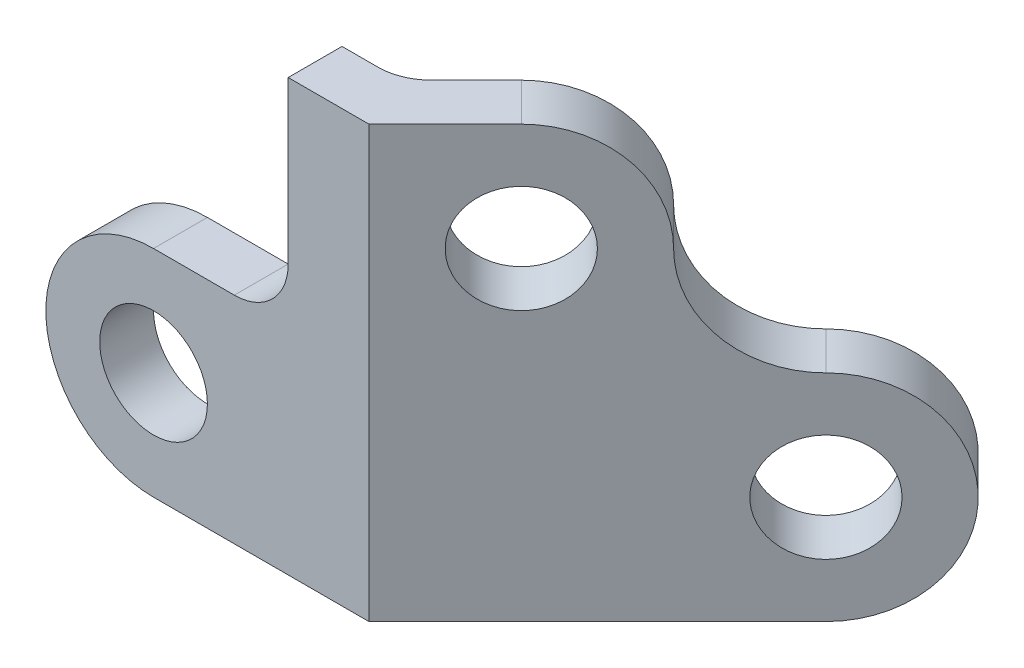
ISO-10303-21;
HEADER;
FILE_DESCRIPTION(('STEP AP214'),'2;1');
FILE_NAME('part.step','',(''),(''),'','','');
FILE_SCHEMA(('AUTOMOTIVE_DESIGN { 1 0 10303 214 1 1 1 1 }'));
ENDSEC;
DATA;
#1=APPLICATION_CONTEXT('core data for automotive mechanical design processes');
#2=APPLICATION_PROTOCOL_DEFINITION('international standard','automotive_design',2000,#1);
#3=PRODUCT_CONTEXT('',#1,'mechanical');
#4=PRODUCT('Part','Part','',(#3));
#5=PRODUCT_RELATED_PRODUCT_CATEGORY('part','',(#4));
#6=PRODUCT_DEFINITION_FORMATION('','',#4);
#7=PRODUCT_DEFINITION_CONTEXT('part definition',#1,'design');
#8=PRODUCT_DEFINITION('design','',#6,#7);
#9=PRODUCT_DEFINITION_SHAPE('','',#8);
#10=(LENGTH_UNIT() NAMED_UNIT(*) SI_UNIT(.MILLI.,.METRE.));
#11=(NAMED_UNIT(*) PLANE_ANGLE_UNIT() SI_UNIT($,.RADIAN.));
#12=(NAMED_UNIT(*) SI_UNIT($,.STERADIAN.) SOLID_ANGLE_UNIT());
#13=UNCERTAINTY_MEASURE_WITH_UNIT(LENGTH_MEASURE(1.E-05),#10,'distance_accuracy_value','');
#14=(GEOMETRIC_REPRESENTATION_CONTEXT(3) GLOBAL_UNCERTAINTY_ASSIGNED_CONTEXT((#13)) GLOBAL_UNIT_ASSIGNED_CONTEXT((#10,
#11,#12)) REPRESENTATION_CONTEXT('',''));
#15=CARTESIAN_POINT('',(0.,0.,0.));
#16=DIRECTION('',(0.,0.,1.));
#17=DIRECTION('',(1.,0.,0.));
#18=AXIS2_PLACEMENT_3D('',#15,#16,#17);
#19=CARTESIAN_POINT('',(-25.,50.,-10.));
#20=DIRECTION('',(0.,0.,-1.));
#21=DIRECTION('',(-1.,0.,0.));
#22=AXIS2_PLACEMENT_3D('',#19,#20,#21);
#23=PLANE('',#22);
#24=CARTESIAN_POINT('',(-40.,20.,-10.));
#25=DIRECTION('',(0.,0.,1.));
#26=DIRECTION('',(1.,0.,0.));
#27=AXIS2_PLACEMENT_3D('',#24,#25,#26);
#28=CIRCLE('',#27,10.);
#29=CARTESIAN_POINT('',(-30.,20.,-10.));
#30=VERTEX_POINT('',#29);
#31=EDGE_CURVE('E166',#30,#30,#28,.T.);
#32=ORIENTED_EDGE('',*,*,#31,.T.);
#33=EDGE_LOOP('',(#32));
#34=FACE_BOUND('',#33,.T.);
#35=DIRECTION('',(-1.,0.,0.));
#36=VECTOR('',#35,1.);
#37=CARTESIAN_POINT('',(0.,80.,-10.));
#38=LINE('',#37,#36);
#39=CARTESIAN_POINT('',(-8.28427124746191,80.,-10.));
#40=VERTEX_POINT('',#39);
#41=CARTESIAN_POINT('',(-15.,80.,-10.));
#42=VERTEX_POINT('',#41);
#43=EDGE_CURVE('E172',#40,#42,#38,.T.);
#44=ORIENTED_EDGE('',*,*,#43,.F.);
#45=DIRECTION('',(0.,-1.,0.));
#46=VECTOR('',#45,1.);
#47=CARTESIAN_POINT('',(-8.28427124746191,50.,-10.));
#48=LINE('',#47,#46);
#49=CARTESIAN_POINT('',(-8.28427124746191,0.,-10.));
#50=VERTEX_POINT('',#49);
#51=EDGE_CURVE('E211',#40,#50,#48,.T.);
#52=ORIENTED_EDGE('',*,*,#51,.T.);
#53=DIRECTION('',(1.,0.,0.));
#54=VECTOR('',#53,1.);
#55=CARTESIAN_POINT('',(0.,0.,-10.));
#56=LINE('',#55,#54);
#57=CARTESIAN_POINT('',(-40.,0.,-10.));
#58=VERTEX_POINT('',#57);
#59=EDGE_CURVE('E187',#58,#50,#56,.T.);
#60=ORIENTED_EDGE('',*,*,#59,.F.);
#61=CARTESIAN_POINT('',(-40.,20.,-10.));
#62=DIRECTION('',(0.,0.,1.));
#63=DIRECTION('',(-1.,0.,0.));
#64=AXIS2_PLACEMENT_3D('',#61,#62,#63);
#65=CIRCLE('',#64,20.);
#66=CARTESIAN_POINT('',(-40.,40.,-10.));
#67=VERTEX_POINT('',#66);
#68=EDGE_CURVE('E184',#67,#58,#65,.T.);
#69=ORIENTED_EDGE('',*,*,#68,.F.);
#70=DIRECTION('',(-1.,0.,0.));
#71=VECTOR('',#70,1.);
#72=CARTESIAN_POINT('',(-40.,40.,-10.));
#73=LINE('',#72,#71);
#74=CARTESIAN_POINT('',(-25.,40.,-10.));
#75=VERTEX_POINT('',#74);
#76=EDGE_CURVE('E181',#75,#67,#73,.T.);
#77=ORIENTED_EDGE('',*,*,#76,.F.);
#78=CARTESIAN_POINT('',(-25.,50.,-10.));
#79=DIRECTION('',(0.,0.,-1.));
#80=DIRECTION('',(-1.,0.,0.));
#81=AXIS2_PLACEMENT_3D('',#78,#79,#80);
#82=CIRCLE('',#81,10.);
#83=CARTESIAN_POINT('',(-15.,50.,-10.));
#84=VERTEX_POINT('',#83);
#85=EDGE_CURVE('E178',#84,#75,#82,.T.);
#86=ORIENTED_EDGE('',*,*,#85,.F.);
#87=DIRECTION('',(0.,-1.,0.));
#88=VECTOR('',#87,1.);
#89=CARTESIAN_POINT('',(-15.,50.,-10.));
#90=LINE('',#89,#88);
#91=EDGE_CURVE('E174',#42,#84,#90,.T.);
#92=ORIENTED_EDGE('',*,*,#91,.F.);
#93=EDGE_LOOP('',(#44,#52,#60,#69,#77,#86,#92));
#94=FACE_BOUND('',#93,.T.);
#95=ADVANCED_FACE('F33',(#34,#94),#23,.T.);
#96=CARTESIAN_POINT('',(0.,80.,-10.));
#97=DIRECTION('',(0.,1.,0.));
#98=DIRECTION('',(0.,0.,1.));
#99=AXIS2_PLACEMENT_3D('',#96,#97,#98);
#100=PLANE('',#99);
#101=DIRECTION('',(-1.,0.,0.));
#102=VECTOR('',#101,1.);
#103=CARTESIAN_POINT('',(0.,80.,0.));
#104=LINE('',#103,#102);
#105=CARTESIAN_POINT('',(0.,80.,0.));
#106=VERTEX_POINT('',#105);
#107=CARTESIAN_POINT('',(-15.,80.,0.));
#108=VERTEX_POINT('',#107);
#109=EDGE_CURVE('E169',#106,#108,#104,.T.);
#110=ORIENTED_EDGE('',*,*,#109,.F.);
#111=DIRECTION('',(-0.707106781186546,0.,0.707106781186549));
#112=VECTOR('',#111,1.);
#113=CARTESIAN_POINT('',(14.1421356237309,80.,-14.142135623731));
#114=LINE('',#113,#112);
#115=CARTESIAN_POINT('',(14.1421356237309,80.,-14.142135623731));
#116=VERTEX_POINT('',#115);
#117=EDGE_CURVE('E148',#116,#106,#114,.T.);
#118=ORIENTED_EDGE('',*,*,#117,.F.);
#119=DIRECTION('',(0.707106781186549,0.,0.707106781186546));
#120=VECTOR('',#119,1.);
#121=CARTESIAN_POINT('',(7.07106781186543,80.,-21.2132034355964));
#122=LINE('',#121,#120);
#123=CARTESIAN_POINT('',(7.07106781186543,80.,-21.2132034355964));
#124=VERTEX_POINT('',#123);
#125=EDGE_CURVE('E160',#124,#116,#122,.T.);
#126=ORIENTED_EDGE('',*,*,#125,.F.);
#127=DIRECTION('',(-0.707106781186546,0.,0.707106781186549));
#128=VECTOR('',#127,1.);
#129=CARTESIAN_POINT('',(7.07106781186543,80.,-21.2132034355964));
#130=LINE('',#129,#128);
#131=CARTESIAN_POINT('',(-1.21320343559643,80.,-12.9289321881345));
#132=VERTEX_POINT('',#131);
#133=EDGE_CURVE('E125',#124,#132,#130,.T.);
#134=ORIENTED_EDGE('',*,*,#133,.T.);
#135=CARTESIAN_POINT('',(-8.28427124746191,80.,-20.));
#136=DIRECTION('',(0.,1.,0.));
#137=DIRECTION('',(0.,0.,1.));
#138=AXIS2_PLACEMENT_3D('',#135,#136,#137);
#139=CIRCLE('',#138,10.);
#140=EDGE_CURVE('E11',#132,#40,#139,.F.);
#141=ORIENTED_EDGE('',*,*,#140,.T.);
#142=ORIENTED_EDGE('',*,*,#43,.T.);
#143=DIRECTION('',(0.,0.,1.));
#144=VECTOR('',#143,1.);
#145=CARTESIAN_POINT('',(-15.,80.,-10.));
#146=LINE('',#145,#144);
#147=EDGE_CURVE('E189',#42,#108,#146,.T.);
#148=ORIENTED_EDGE('',*,*,#147,.T.);
#149=EDGE_LOOP('',(#110,#118,#126,#134,#141,#142,#148));
#150=FACE_BOUND('',#149,.T.);
#151=ADVANCED_FACE('F247',(#150),#100,.T.);
#152=CARTESIAN_POINT('',(0.,0.,-10.));
#153=DIRECTION('',(0.,-1.,0.));
#154=DIRECTION('',(1.,0.,0.));
#155=AXIS2_PLACEMENT_3D('',#152,#153,#154);
#156=PLANE('',#155);
#157=DIRECTION('',(0.707106781186546,0.,-0.707106781186549));
#158=VECTOR('',#157,1.);
#159=CARTESIAN_POINT('',(42.4264068711928,0.,-42.4264068711929));
#160=LINE('',#159,#158);
#161=CARTESIAN_POINT('',(0.,0.,0.));
#162=VERTEX_POINT('',#161);
#163=CARTESIAN_POINT('',(42.4264068711928,0.,-42.4264068711929));
#164=VERTEX_POINT('',#163);
#165=EDGE_CURVE('E150',#162,#164,#160,.T.);
#166=ORIENTED_EDGE('',*,*,#165,.F.);
#167=DIRECTION('',(1.,0.,0.));
#168=VECTOR('',#167,1.);
#169=CARTESIAN_POINT('',(0.,0.,0.));
#170=LINE('',#169,#168);
#171=CARTESIAN_POINT('',(-40.,0.,0.));
#172=VERTEX_POINT('',#171);
#173=EDGE_CURVE('E204',#172,#162,#170,.T.);
#174=ORIENTED_EDGE('',*,*,#173,.F.);
#175=DIRECTION('',(0.,0.,1.));
#176=VECTOR('',#175,1.);
#177=CARTESIAN_POINT('',(-40.,0.,-10.));
#178=LINE('',#177,#176);
#179=EDGE_CURVE('E209',#58,#172,#178,.T.);
#180=ORIENTED_EDGE('',*,*,#179,.F.);
#181=ORIENTED_EDGE('',*,*,#59,.T.);
#182=CARTESIAN_POINT('',(-8.28427124746191,0.,-20.));
#183=DIRECTION('',(0.,-1.,0.));
#184=DIRECTION('',(1.,0.,0.));
#185=AXIS2_PLACEMENT_3D('',#182,#183,#184);
#186=CIRCLE('',#185,10.);
#187=CARTESIAN_POINT('',(-1.21320343559643,0.,-12.9289321881345));
#188=VERTEX_POINT('',#187);
#189=EDGE_CURVE('E41',#50,#188,#186,.F.);
#190=ORIENTED_EDGE('',*,*,#189,.T.);
#191=DIRECTION('',(0.707106781186546,0.,-0.707106781186549));
#192=VECTOR('',#191,1.);
#193=CARTESIAN_POINT('',(35.3553390593273,0.,-49.4974746830584));
#194=LINE('',#193,#192);
#195=CARTESIAN_POINT('',(35.3553390593273,0.,-49.4974746830584));
#196=VERTEX_POINT('',#195);
#197=EDGE_CURVE('E118',#188,#196,#194,.T.);
#198=ORIENTED_EDGE('',*,*,#197,.T.);
#199=DIRECTION('',(0.707106781186549,0.,0.707106781186546));
#200=VECTOR('',#199,1.);
#201=CARTESIAN_POINT('',(35.3553390593273,0.,-49.4974746830584));
#202=LINE('',#201,#200);
#203=EDGE_CURVE('E121',#196,#164,#202,.T.);
#204=ORIENTED_EDGE('',*,*,#203,.T.);
#205=EDGE_LOOP('',(#166,#174,#180,#181,#190,#198,#204));
#206=FACE_BOUND('',#205,.T.);
#207=ADVANCED_FACE('F120',(#206),#156,.T.);
#208=CARTESIAN_POINT('',(-40.,20.,-10.));
#209=DIRECTION('',(0.,0.,1.));
#210=DIRECTION('',(1.,0.,0.));
#211=AXIS2_PLACEMENT_3D('',#208,#209,#210);
#212=CYLINDRICAL_SURFACE('',#211,20.);
#213=CARTESIAN_POINT('',(-40.,20.,0.));
#214=DIRECTION('',(0.,0.,1.));
#215=DIRECTION('',(-1.,0.,0.));
#216=AXIS2_PLACEMENT_3D('',#213,#214,#215);
#217=CIRCLE('',#216,20.);
#218=CARTESIAN_POINT('',(-40.,40.,0.));
#219=VERTEX_POINT('',#218);
#220=EDGE_CURVE('E201',#219,#172,#217,.T.);
#221=ORIENTED_EDGE('',*,*,#220,.F.);
#222=DIRECTION('',(0.,0.,1.));
#223=VECTOR('',#222,1.);
#224=CARTESIAN_POINT('',(-40.,40.,-10.));
#225=LINE('',#224,#223);
#226=EDGE_CURVE('E212',#67,#219,#225,.T.);
#227=ORIENTED_EDGE('',*,*,#226,.F.);
#228=ORIENTED_EDGE('',*,*,#68,.T.);
#229=ORIENTED_EDGE('',*,*,#179,.T.);
#230=EDGE_LOOP('',(#221,#227,#228,#229));
#231=FACE_BOUND('',#230,.T.);
#232=ADVANCED_FACE('F232',(#231),#212,.T.);
#233=CARTESIAN_POINT('',(-40.,40.,-10.));
#234=DIRECTION('',(0.,1.,0.));
#235=DIRECTION('',(0.,0.,1.));
#236=AXIS2_PLACEMENT_3D('',#233,#234,#235);
#237=PLANE('',#236);
#238=DIRECTION('',(-1.,0.,0.));
#239=VECTOR('',#238,1.);
#240=CARTESIAN_POINT('',(-40.,40.,0.));
#241=LINE('',#240,#239);
#242=CARTESIAN_POINT('',(-25.,40.,0.));
#243=VERTEX_POINT('',#242);
#244=EDGE_CURVE('E198',#243,#219,#241,.T.);
#245=ORIENTED_EDGE('',*,*,#244,.F.);
#246=DIRECTION('',(0.,0.,1.));
#247=VECTOR('',#246,1.);
#248=CARTESIAN_POINT('',(-25.,40.,-10.));
#249=LINE('',#248,#247);
#250=EDGE_CURVE('E214',#75,#243,#249,.T.);
#251=ORIENTED_EDGE('',*,*,#250,.F.);
#252=ORIENTED_EDGE('',*,*,#76,.T.);
#253=ORIENTED_EDGE('',*,*,#226,.T.);
#254=EDGE_LOOP('',(#245,#251,#252,#253));
#255=FACE_BOUND('',#254,.T.);
#256=ADVANCED_FACE('F237',(#255),#237,.T.);
#257=CARTESIAN_POINT('',(-25.,50.,-10.));
#258=DIRECTION('',(0.,0.,1.));
#259=DIRECTION('',(1.,0.,0.));
#260=AXIS2_PLACEMENT_3D('',#257,#258,#259);
#261=CYLINDRICAL_SURFACE('',#260,10.);
#262=CARTESIAN_POINT('',(-25.,50.,0.));
#263=DIRECTION('',(0.,0.,-1.));
#264=DIRECTION('',(-1.,0.,0.));
#265=AXIS2_PLACEMENT_3D('',#262,#263,#264);
#266=CIRCLE('',#265,10.);
#267=CARTESIAN_POINT('',(-15.,50.,0.));
#268=VERTEX_POINT('',#267);
#269=EDGE_CURVE('E195',#268,#243,#266,.T.);
#270=ORIENTED_EDGE('',*,*,#269,.F.);
#271=DIRECTION('',(0.,0.,1.));
#272=VECTOR('',#271,1.);
#273=CARTESIAN_POINT('',(-15.,50.,-10.));
#274=LINE('',#273,#272);
#275=EDGE_CURVE('E216',#84,#268,#274,.T.);
#276=ORIENTED_EDGE('',*,*,#275,.F.);
#277=ORIENTED_EDGE('',*,*,#85,.T.);
#278=ORIENTED_EDGE('',*,*,#250,.T.);
#279=EDGE_LOOP('',(#270,#276,#277,#278));
#280=FACE_BOUND('',#279,.T.);
#281=ADVANCED_FACE('F240',(#280),#261,.F.);
#282=CARTESIAN_POINT('',(-15.,50.,-10.));
#283=DIRECTION('',(-1.,0.,0.));
#284=DIRECTION('',(0.,-1.,0.));
#285=AXIS2_PLACEMENT_3D('',#282,#283,#284);
#286=PLANE('',#285);
#287=DIRECTION('',(0.,-1.,0.));
#288=VECTOR('',#287,1.);
#289=CARTESIAN_POINT('',(-15.,50.,0.));
#290=LINE('',#289,#288);
#291=EDGE_CURVE('E192',#108,#268,#290,.T.);
#292=ORIENTED_EDGE('',*,*,#291,.F.);
#293=ORIENTED_EDGE('',*,*,#147,.F.);
#294=ORIENTED_EDGE('',*,*,#91,.T.);
#295=ORIENTED_EDGE('',*,*,#275,.T.);
#296=EDGE_LOOP('',(#292,#293,#294,#295));
#297=FACE_BOUND('',#296,.T.);
#298=ADVANCED_FACE('F244',(#297),#286,.T.);
#299=CARTESIAN_POINT('',(-25.,50.,0.));
#300=DIRECTION('',(0.,0.,-1.));
#301=DIRECTION('',(-1.,0.,0.));
#302=AXIS2_PLACEMENT_3D('',#299,#300,#301);
#303=PLANE('',#302);
#304=CARTESIAN_POINT('',(-40.,20.,0.));
#305=DIRECTION('',(0.,0.,1.));
#306=DIRECTION('',(1.,0.,0.));
#307=AXIS2_PLACEMENT_3D('',#304,#305,#306);
#308=CIRCLE('',#307,10.);
#309=CARTESIAN_POINT('',(-30.,20.,0.));
#310=VERTEX_POINT('',#309);
#311=EDGE_CURVE('E162',#310,#310,#308,.T.);
#312=ORIENTED_EDGE('',*,*,#311,.F.);
#313=EDGE_LOOP('',(#312));
#314=FACE_BOUND('',#313,.T.);
#315=ORIENTED_EDGE('',*,*,#109,.T.);
#316=ORIENTED_EDGE('',*,*,#291,.T.);
#317=ORIENTED_EDGE('',*,*,#269,.T.);
#318=ORIENTED_EDGE('',*,*,#244,.T.);
#319=ORIENTED_EDGE('',*,*,#220,.T.);
#320=ORIENTED_EDGE('',*,*,#173,.T.);
#321=DIRECTION('',(0.,1.,0.));
#322=VECTOR('',#321,1.);
#323=CARTESIAN_POINT('',(0.,80.,0.));
#324=LINE('',#323,#322);
#325=EDGE_CURVE('E175',#162,#106,#324,.T.);
#326=ORIENTED_EDGE('',*,*,#325,.T.);
#327=EDGE_LOOP('',(#315,#316,#317,#318,#319,#320,#326));
#328=FACE_BOUND('',#327,.T.);
#329=ADVANCED_FACE('F268',(#314,#328),#303,.F.);
#330=CARTESIAN_POINT('',(-40.,20.,-10.));
#331=DIRECTION('',(0.,0.,1.));
#332=DIRECTION('',(1.,0.,0.));
#333=AXIS2_PLACEMENT_3D('',#330,#331,#332);
#334=CYLINDRICAL_SURFACE('',#333,10.);
#335=ORIENTED_EDGE('',*,*,#31,.F.);
#336=EDGE_LOOP('',(#335));
#337=FACE_BOUND('',#336,.T.);
#338=ORIENTED_EDGE('',*,*,#311,.T.);
#339=EDGE_LOOP('',(#338));
#340=FACE_BOUND('',#339,.T.);
#341=ADVANCED_FACE('F266',(#337,#340),#334,.F.);
#342=CARTESIAN_POINT('',(7.07106781186544,60.,-21.2132034355964));
#343=DIRECTION('',(0.707106781186549,0.,0.707106781186546));
#344=DIRECTION('',(0.707106781186546,0.,-0.707106781186549));
#345=AXIS2_PLACEMENT_3D('',#342,#343,#344);
#346=CYLINDRICAL_SURFACE('',#345,20.);
#347=CARTESIAN_POINT('',(14.1421356237309,60.,-14.142135623731));
#348=DIRECTION('',(0.707106781186549,0.,0.707106781186546));
#349=DIRECTION('',(-0.707106781186546,0.,0.707106781186549));
#350=AXIS2_PLACEMENT_3D('',#347,#348,#349);
#351=CIRCLE('',#350,20.);
#352=CARTESIAN_POINT('',(28.2842712474619,60.,-28.284271247462));
#353=VERTEX_POINT('',#352);
#354=EDGE_CURVE('E157',#353,#116,#351,.T.);
#355=ORIENTED_EDGE('',*,*,#354,.F.);
#356=DIRECTION('',(0.707106781186549,0.,0.707106781186546));
#357=VECTOR('',#356,1.);
#358=CARTESIAN_POINT('',(21.2132034355964,60.,-35.3553390593274));
#359=LINE('',#358,#357);
#360=CARTESIAN_POINT('',(21.2132034355964,60.,-35.3553390593274));
#361=VERTEX_POINT('',#360);
#362=EDGE_CURVE('E163',#361,#353,#359,.T.);
#363=ORIENTED_EDGE('',*,*,#362,.F.);
#364=CARTESIAN_POINT('',(7.07106781186544,60.,-21.2132034355964));
#365=DIRECTION('',(0.707106781186549,0.,0.707106781186546));
#366=DIRECTION('',(-0.707106781186546,0.,0.707106781186549));
#367=AXIS2_PLACEMENT_3D('',#364,#365,#366);
#368=CIRCLE('',#367,20.);
#369=EDGE_CURVE('E134',#361,#124,#368,.T.);
#370=ORIENTED_EDGE('',*,*,#369,.T.);
#371=ORIENTED_EDGE('',*,*,#125,.T.);
#372=EDGE_LOOP('',(#355,#363,#370,#371));
#373=FACE_BOUND('',#372,.T.);
#374=ADVANCED_FACE('F296',(#373),#346,.T.);
#375=CARTESIAN_POINT('',(35.3553390593273,60.,-49.4974746830584));
#376=DIRECTION('',(0.707106781186549,0.,0.707106781186546));
#377=DIRECTION('',(0.707106781186546,0.,-0.707106781186549));
#378=AXIS2_PLACEMENT_3D('',#375,#376,#377);
#379=CYLINDRICAL_SURFACE('',#378,20.);
#380=CARTESIAN_POINT('',(42.4264068711928,60.,-42.4264068711929));
#381=DIRECTION('',(-0.707106781186549,0.,-0.707106781186546));
#382=DIRECTION('',(0.707106781186546,0.,-0.707106781186549));
#383=AXIS2_PLACEMENT_3D('',#380,#381,#382);
#384=CIRCLE('',#383,20.);
#385=CARTESIAN_POINT('',(42.4264068711928,40.,-42.4264068711929));
#386=VERTEX_POINT('',#385);
#387=EDGE_CURVE('E154',#386,#353,#384,.T.);
#388=ORIENTED_EDGE('',*,*,#387,.F.);
#389=DIRECTION('',(0.707106781186549,0.,0.707106781186546));
#390=VECTOR('',#389,1.);
#391=CARTESIAN_POINT('',(35.3553390593273,40.,-49.4974746830584));
#392=LINE('',#391,#390);
#393=CARTESIAN_POINT('',(35.3553390593273,40.,-49.4974746830584));
#394=VERTEX_POINT('',#393);
#395=EDGE_CURVE('E133',#394,#386,#392,.T.);
#396=ORIENTED_EDGE('',*,*,#395,.F.);
#397=CARTESIAN_POINT('',(35.3553390593273,60.,-49.4974746830584));
#398=DIRECTION('',(-0.707106781186549,0.,-0.707106781186546));
#399=DIRECTION('',(0.707106781186546,0.,-0.707106781186549));
#400=AXIS2_PLACEMENT_3D('',#397,#398,#399);
#401=CIRCLE('',#400,20.);
#402=EDGE_CURVE('E141',#394,#361,#401,.T.);
#403=ORIENTED_EDGE('',*,*,#402,.T.);
#404=ORIENTED_EDGE('',*,*,#362,.T.);
#405=EDGE_LOOP('',(#388,#396,#403,#404));
#406=FACE_BOUND('',#405,.T.);
#407=ADVANCED_FACE('F302',(#406),#379,.F.);
#408=CARTESIAN_POINT('',(35.3553390593273,20.,-49.4974746830584));
#409=DIRECTION('',(0.707106781186549,0.,0.707106781186546));
#410=DIRECTION('',(0.707106781186546,0.,-0.707106781186549));
#411=AXIS2_PLACEMENT_3D('',#408,#409,#410);
#412=CYLINDRICAL_SURFACE('',#411,20.);
#413=CARTESIAN_POINT('',(42.4264068711928,20.,-42.4264068711929));
#414=DIRECTION('',(0.707106781186549,0.,0.707106781186546));
#415=DIRECTION('',(0.707106781186546,0.,-0.707106781186549));
#416=AXIS2_PLACEMENT_3D('',#413,#414,#415);
#417=CIRCLE('',#416,20.);
#418=EDGE_CURVE('E131',#164,#386,#417,.T.);
#419=ORIENTED_EDGE('',*,*,#418,.F.);
#420=ORIENTED_EDGE('',*,*,#203,.F.);
#421=CARTESIAN_POINT('',(35.3553390593273,20.,-49.4974746830584));
#422=DIRECTION('',(0.707106781186549,0.,0.707106781186546));
#423=DIRECTION('',(0.707106781186546,0.,-0.707106781186549));
#424=AXIS2_PLACEMENT_3D('',#421,#422,#423);
#425=CIRCLE('',#424,20.);
#426=EDGE_CURVE('E124',#196,#394,#425,.T.);
#427=ORIENTED_EDGE('',*,*,#426,.T.);
#428=ORIENTED_EDGE('',*,*,#395,.T.);
#429=EDGE_LOOP('',(#419,#420,#427,#428));
#430=FACE_BOUND('',#429,.T.);
#431=ADVANCED_FACE('F129',(#430),#412,.T.);
#432=CARTESIAN_POINT('',(35.3553390593273,20.,-49.4974746830584));
#433=DIRECTION('',(0.707106781186549,0.,0.707106781186546));
#434=DIRECTION('',(0.707106781186546,0.,-0.707106781186549));
#435=AXIS2_PLACEMENT_3D('',#432,#433,#434);
#436=PLANE('',#435);
#437=ORIENTED_EDGE('',*,*,#197,.F.);
#438=DIRECTION('',(0.,-1.,0.));
#439=VECTOR('',#438,1.);
#440=CARTESIAN_POINT('',(-1.21320343559643,20.,-12.9289321881345));
#441=LINE('',#440,#439);
#442=EDGE_CURVE('E54',#188,#132,#441,.F.);
#443=ORIENTED_EDGE('',*,*,#442,.T.);
#444=ORIENTED_EDGE('',*,*,#133,.F.);
#445=ORIENTED_EDGE('',*,*,#369,.F.);
#446=ORIENTED_EDGE('',*,*,#402,.F.);
#447=ORIENTED_EDGE('',*,*,#426,.F.);
#448=EDGE_LOOP('',(#437,#443,#444,#445,#446,#447));
#449=FACE_BOUND('',#448,.T.);
#450=CARTESIAN_POINT('',(35.3553390593273,20.,-49.4974746830584));
#451=DIRECTION('',(0.707106781186549,0.,0.707106781186546));
#452=DIRECTION('',(0.707106781186546,0.,-0.707106781186549));
#453=AXIS2_PLACEMENT_3D('',#450,#451,#452);
#454=CIRCLE('',#453,10.);
#455=CARTESIAN_POINT('',(42.4264068711928,20.,-56.5685424949239));
#456=VERTEX_POINT('',#455);
#457=EDGE_CURVE('E361',#456,#456,#454,.T.);
#458=ORIENTED_EDGE('',*,*,#457,.T.);
#459=EDGE_LOOP('',(#458));
#460=FACE_BOUND('',#459,.T.);
#461=CARTESIAN_POINT('',(7.07106781186544,60.,-21.2132034355964));
#462=DIRECTION('',(0.707106781186549,0.,0.707106781186546));
#463=DIRECTION('',(0.707106781186546,0.,-0.707106781186549));
#464=AXIS2_PLACEMENT_3D('',#461,#462,#463);
#465=CIRCLE('',#464,10.);
#466=CARTESIAN_POINT('',(14.1421356237309,60.,-28.2842712474619));
#467=VERTEX_POINT('',#466);
#468=EDGE_CURVE('E151',#467,#467,#465,.T.);
#469=ORIENTED_EDGE('',*,*,#468,.T.);
#470=EDGE_LOOP('',(#469));
#471=FACE_BOUND('',#470,.T.);
#472=ADVANCED_FACE('F137',(#449,#460,#471),#436,.F.);
#473=CARTESIAN_POINT('',(42.4264068711928,20.,-42.4264068711929));
#474=DIRECTION('',(0.707106781186549,0.,0.707106781186546));
#475=DIRECTION('',(0.707106781186546,0.,-0.707106781186549));
#476=AXIS2_PLACEMENT_3D('',#473,#474,#475);
#477=PLANE('',#476);
#478=CARTESIAN_POINT('',(42.4264068711928,20.,-42.4264068711929));
#479=DIRECTION('',(0.707106781186549,0.,0.707106781186546));
#480=DIRECTION('',(0.707106781186546,0.,-0.707106781186549));
#481=AXIS2_PLACEMENT_3D('',#478,#479,#480);
#482=CIRCLE('',#481,10.);
#483=CARTESIAN_POINT('',(49.4974746830582,20.,-49.4974746830584));
#484=VERTEX_POINT('',#483);
#485=EDGE_CURVE('E365',#484,#484,#482,.T.);
#486=ORIENTED_EDGE('',*,*,#485,.F.);
#487=EDGE_LOOP('',(#486));
#488=FACE_BOUND('',#487,.T.);
#489=CARTESIAN_POINT('',(14.1421356237309,60.,-14.142135623731));
#490=DIRECTION('',(0.707106781186549,0.,0.707106781186546));
#491=DIRECTION('',(0.707106781186546,0.,-0.707106781186549));
#492=AXIS2_PLACEMENT_3D('',#489,#490,#491);
#493=CIRCLE('',#492,10.);
#494=CARTESIAN_POINT('',(21.2132034355964,60.,-21.2132034355965));
#495=VERTEX_POINT('',#494);
#496=EDGE_CURVE('E359',#495,#495,#493,.T.);
#497=ORIENTED_EDGE('',*,*,#496,.F.);
#498=EDGE_LOOP('',(#497));
#499=FACE_BOUND('',#498,.T.);
#500=ORIENTED_EDGE('',*,*,#117,.T.);
#501=ORIENTED_EDGE('',*,*,#325,.F.);
#502=ORIENTED_EDGE('',*,*,#165,.T.);
#503=ORIENTED_EDGE('',*,*,#418,.T.);
#504=ORIENTED_EDGE('',*,*,#387,.T.);
#505=ORIENTED_EDGE('',*,*,#354,.T.);
#506=EDGE_LOOP('',(#500,#501,#502,#503,#504,#505));
#507=FACE_BOUND('',#506,.T.);
#508=ADVANCED_FACE('F324',(#488,#499,#507),#477,.T.);
#509=CARTESIAN_POINT('',(7.07106781186544,60.,-21.2132034355964));
#510=DIRECTION('',(0.707106781186549,0.,0.707106781186546));
#511=DIRECTION('',(0.707106781186546,0.,-0.707106781186549));
#512=AXIS2_PLACEMENT_3D('',#509,#510,#511);
#513=CYLINDRICAL_SURFACE('',#512,10.);
#514=ORIENTED_EDGE('',*,*,#468,.F.);
#515=EDGE_LOOP('',(#514));
#516=FACE_BOUND('',#515,.T.);
#517=ORIENTED_EDGE('',*,*,#496,.T.);
#518=EDGE_LOOP('',(#517));
#519=FACE_BOUND('',#518,.T.);
#520=ADVANCED_FACE('F254',(#516,#519),#513,.F.);
#521=CARTESIAN_POINT('',(35.3553390593273,20.,-49.4974746830584));
#522=DIRECTION('',(0.707106781186549,0.,0.707106781186546));
#523=DIRECTION('',(0.707106781186546,0.,-0.707106781186549));
#524=AXIS2_PLACEMENT_3D('',#521,#522,#523);
#525=CYLINDRICAL_SURFACE('',#524,10.);
#526=ORIENTED_EDGE('',*,*,#457,.F.);
#527=EDGE_LOOP('',(#526));
#528=FACE_BOUND('',#527,.T.);
#529=ORIENTED_EDGE('',*,*,#485,.T.);
#530=EDGE_LOOP('',(#529));
#531=FACE_BOUND('',#530,.T.);
#532=ADVANCED_FACE('F250',(#528,#531),#525,.F.);
#533=CARTESIAN_POINT('',(-8.28427124746191,50.,-20.));
#534=DIRECTION('',(0.,-1.,0.));
#535=DIRECTION('',(1.,0.,0.));
#536=AXIS2_PLACEMENT_3D('',#533,#534,#535);
#537=CYLINDRICAL_SURFACE('',#536,10.);
#538=ORIENTED_EDGE('',*,*,#140,.F.);
#539=ORIENTED_EDGE('',*,*,#442,.F.);
#540=ORIENTED_EDGE('',*,*,#189,.F.);
#541=ORIENTED_EDGE('',*,*,#51,.F.);
#542=EDGE_LOOP('',(#538,#539,#540,#541));
#543=FACE_BOUND('',#542,.T.);
#544=ADVANCED_FACE('F35',(#543),#537,.F.);
#545=CLOSED_SHELL('',(#95,#151,#207,#232,#256,#281,#298,#329,#341,#374,#407,#431,#472,#508,#520,
#532,#544));
#546=MANIFOLD_SOLID_BREP('B2',#545);
#547=ADVANCED_BREP_SHAPE_REPRESENTATION('',(#18,#546),#14);
#548=SHAPE_DEFINITION_REPRESENTATION(#9,#547);
ENDSEC;
END-ISO-10303-21;
